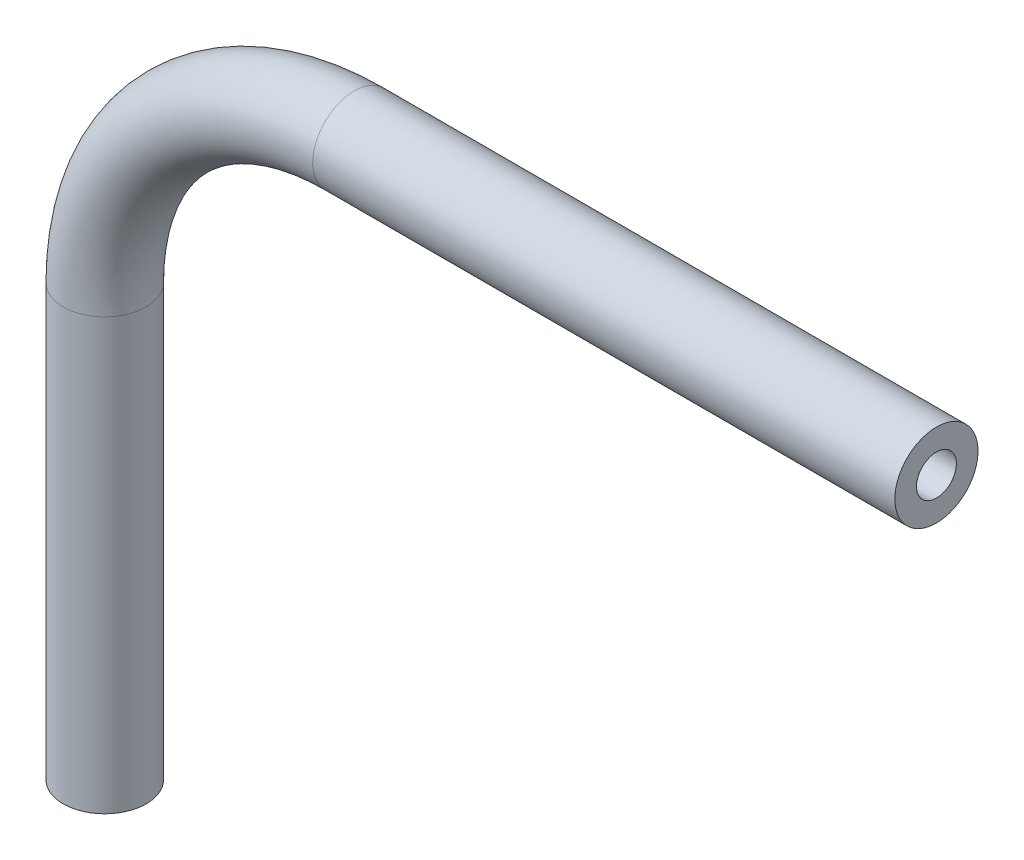
ISO-10303-21;
HEADER;
FILE_DESCRIPTION(('STEP AP214'),'2;1');
FILE_NAME('part.step','',(''),(''),'','','');
FILE_SCHEMA(('AUTOMOTIVE_DESIGN { 1 0 10303 214 1 1 1 1 }'));
ENDSEC;
DATA;
#1=APPLICATION_CONTEXT('core data for automotive mechanical design processes');
#2=APPLICATION_PROTOCOL_DEFINITION('international standard','automotive_design',2000,#1);
#3=PRODUCT_CONTEXT('',#1,'mechanical');
#4=PRODUCT('Part','Part','',(#3));
#5=PRODUCT_RELATED_PRODUCT_CATEGORY('part','',(#4));
#6=PRODUCT_DEFINITION_FORMATION('','',#4);
#7=PRODUCT_DEFINITION_CONTEXT('part definition',#1,'design');
#8=PRODUCT_DEFINITION('design','',#6,#7);
#9=PRODUCT_DEFINITION_SHAPE('','',#8);
#10=(LENGTH_UNIT() NAMED_UNIT(*) SI_UNIT(.MILLI.,.METRE.));
#11=(NAMED_UNIT(*) PLANE_ANGLE_UNIT() SI_UNIT($,.RADIAN.));
#12=(NAMED_UNIT(*) SI_UNIT($,.STERADIAN.) SOLID_ANGLE_UNIT());
#13=UNCERTAINTY_MEASURE_WITH_UNIT(LENGTH_MEASURE(1.E-05),#10,'distance_accuracy_value','');
#14=(GEOMETRIC_REPRESENTATION_CONTEXT(3) GLOBAL_UNCERTAINTY_ASSIGNED_CONTEXT((#13)) GLOBAL_UNIT_ASSIGNED_CONTEXT((#10,
#11,#12)) REPRESENTATION_CONTEXT('',''));
#15=CARTESIAN_POINT('',(0.,0.,0.));
#16=DIRECTION('',(0.,0.,1.));
#17=DIRECTION('',(1.,0.,0.));
#18=AXIS2_PLACEMENT_3D('',#15,#16,#17);
#19=CARTESIAN_POINT('',(0.,-34.3807738807946,0.));
#20=DIRECTION('',(0.,1.,0.));
#21=DIRECTION('',(-1.,0.,0.));
#22=AXIS2_PLACEMENT_3D('',#19,#20,#21);
#23=CYLINDRICAL_SURFACE('',#22,3.175);
#24=CARTESIAN_POINT('',(0.,-1.52231788079482,0.));
#25=DIRECTION('',(0.,1.,0.));
#26=DIRECTION('',(-1.,0.,0.));
#27=AXIS2_PLACEMENT_3D('',#24,#25,#26);
#28=CIRCLE('',#27,3.175);
#29=CARTESIAN_POINT('',(-3.175,-1.52231788079484,0.));
#30=VERTEX_POINT('',#29);
#31=EDGE_CURVE('E84',#30,#30,#28,.T.);
#32=ORIENTED_EDGE('',*,*,#31,.F.);
#33=EDGE_LOOP('',(#32));
#34=FACE_BOUND('',#33,.T.);
#35=CARTESIAN_POINT('',(0.,-34.3807738807946,0.));
#36=DIRECTION('',(0.,1.,0.));
#37=DIRECTION('',(-1.,0.,0.));
#38=AXIS2_PLACEMENT_3D('',#35,#36,#37);
#39=CIRCLE('',#38,3.175);
#40=CARTESIAN_POINT('',(-3.175,-34.3807738807946,0.));
#41=VERTEX_POINT('',#40);
#42=EDGE_CURVE('E53',#41,#41,#39,.T.);
#43=ORIENTED_EDGE('',*,*,#42,.T.);
#44=EDGE_LOOP('',(#43));
#45=FACE_BOUND('',#44,.T.);
#46=ADVANCED_FACE('F38',(#34,#45),#23,.T.);
#47=CARTESIAN_POINT('',(19.05,-1.52231788079469,0.));
#48=DIRECTION('',(0.,0.,-1.));
#49=DIRECTION('',(-1.,0.,0.));
#50=AXIS2_PLACEMENT_3D('',#47,#48,#49);
#51=TOROIDAL_SURFACE('',#50,19.05,3.175);
#52=CARTESIAN_POINT('',(19.0500000000001,17.5276821192053,0.));
#53=DIRECTION('',(1.,0.,0.));
#54=DIRECTION('',(0.,1.,0.));
#55=AXIS2_PLACEMENT_3D('',#52,#53,#54);
#56=CIRCLE('',#55,3.175);
#57=CARTESIAN_POINT('',(19.0500000000001,20.7026821192053,0.));
#58=VERTEX_POINT('',#57);
#59=EDGE_CURVE('E42',#58,#58,#56,.T.);
#60=CARTESIAN_POINT('',(19.05,-1.52231788079469,0.));
#61=DIRECTION('',(0.,0.,-1.));
#62=DIRECTION('',(-1.,0.,0.));
#63=AXIS2_PLACEMENT_3D('',#60,#61,#62);
#64=CIRCLE('',#63,22.225);
#65=EDGE_CURVE('',#30,#58,#64,.T.);
#66=ORIENTED_EDGE('',*,*,#31,.T.);
#67=ORIENTED_EDGE('',*,*,#59,.F.);
#68=ORIENTED_EDGE('',*,*,#65,.T.);
#69=ORIENTED_EDGE('',*,*,#65,.F.);
#70=EDGE_LOOP('',(#66,#68,#67,#69));
#71=FACE_BOUND('',#70,.T.);
#72=ADVANCED_FACE('F92',(#71),#51,.T.);
#73=CARTESIAN_POINT('',(19.0500000000001,17.5276821192053,0.));
#74=DIRECTION('',(1.,0.,0.));
#75=DIRECTION('',(0.,1.,0.));
#76=AXIS2_PLACEMENT_3D('',#73,#74,#75);
#77=CYLINDRICAL_SURFACE('',#76,3.175);
#78=CARTESIAN_POINT('',(63.5,17.5276821192052,0.));
#79=DIRECTION('',(1.,0.,0.));
#80=DIRECTION('',(0.,1.,0.));
#81=AXIS2_PLACEMENT_3D('',#78,#79,#80);
#82=CIRCLE('',#81,3.175);
#83=CARTESIAN_POINT('',(63.5,20.7026821192052,0.));
#84=VERTEX_POINT('',#83);
#85=EDGE_CURVE('E58',#84,#84,#82,.T.);
#86=ORIENTED_EDGE('',*,*,#85,.F.);
#87=EDGE_LOOP('',(#86));
#88=FACE_BOUND('',#87,.T.);
#89=ORIENTED_EDGE('',*,*,#59,.T.);
#90=EDGE_LOOP('',(#89));
#91=FACE_BOUND('',#90,.T.);
#92=ADVANCED_FACE('F40',(#88,#91),#77,.T.);
#93=CARTESIAN_POINT('',(0.,-34.3807738807946,0.));
#94=DIRECTION('',(0.,1.,0.));
#95=DIRECTION('',(-1.,0.,0.));
#96=AXIS2_PLACEMENT_3D('',#93,#94,#95);
#97=PLANE('',#96);
#98=CARTESIAN_POINT('',(0.,-34.3807738807946,0.));
#99=DIRECTION('',(0.,1.,0.));
#100=DIRECTION('',(-1.,0.,0.));
#101=AXIS2_PLACEMENT_3D('',#98,#99,#100);
#102=CIRCLE('',#101,1.524);
#103=CARTESIAN_POINT('',(-1.524,-34.3807738807946,0.));
#104=VERTEX_POINT('',#103);
#105=EDGE_CURVE('E79',#104,#104,#102,.F.);
#106=ORIENTED_EDGE('',*,*,#105,.F.);
#107=EDGE_LOOP('',(#106));
#108=FACE_BOUND('',#107,.T.);
#109=ORIENTED_EDGE('',*,*,#42,.F.);
#110=EDGE_LOOP('',(#109));
#111=FACE_BOUND('',#110,.T.);
#112=ADVANCED_FACE('F98',(#108,#111),#97,.F.);
#113=CARTESIAN_POINT('',(63.5,17.5276821192052,0.));
#114=DIRECTION('',(1.,0.,0.));
#115=DIRECTION('',(0.,1.,0.));
#116=AXIS2_PLACEMENT_3D('',#113,#114,#115);
#117=PLANE('',#116);
#118=CARTESIAN_POINT('',(63.5,17.5276821192052,0.));
#119=DIRECTION('',(1.,0.,0.));
#120=DIRECTION('',(0.,1.,0.));
#121=AXIS2_PLACEMENT_3D('',#118,#119,#120);
#122=CIRCLE('',#121,1.524);
#123=CARTESIAN_POINT('',(63.5,19.0516821192052,0.));
#124=VERTEX_POINT('',#123);
#125=EDGE_CURVE('E11',#124,#124,#122,.F.);
#126=ORIENTED_EDGE('',*,*,#125,.T.);
#127=EDGE_LOOP('',(#126));
#128=FACE_BOUND('',#127,.T.);
#129=ORIENTED_EDGE('',*,*,#85,.T.);
#130=EDGE_LOOP('',(#129));
#131=FACE_BOUND('',#130,.T.);
#132=ADVANCED_FACE('F65',(#128,#131),#117,.T.);
#133=CARTESIAN_POINT('',(0.,-34.3807738807946,0.));
#134=DIRECTION('',(0.,1.,0.));
#135=DIRECTION('',(-1.,0.,0.));
#136=AXIS2_PLACEMENT_3D('',#133,#134,#135);
#137=CYLINDRICAL_SURFACE('',#136,1.524);
#138=CARTESIAN_POINT('',(0.,-1.52231788079482,0.));
#139=DIRECTION('',(0.,1.,0.));
#140=DIRECTION('',(-1.,0.,0.));
#141=AXIS2_PLACEMENT_3D('',#138,#139,#140);
#142=CIRCLE('',#141,1.524);
#143=CARTESIAN_POINT('',(-1.524,-1.52231788079483,0.));
#144=VERTEX_POINT('',#143);
#145=EDGE_CURVE('E76',#144,#144,#142,.F.);
#146=ORIENTED_EDGE('',*,*,#145,.F.);
#147=EDGE_LOOP('',(#146));
#148=FACE_BOUND('',#147,.T.);
#149=ORIENTED_EDGE('',*,*,#105,.T.);
#150=EDGE_LOOP('',(#149));
#151=FACE_BOUND('',#150,.T.);
#152=ADVANCED_FACE('F106',(#148,#151),#137,.F.);
#153=CARTESIAN_POINT('',(19.05,-1.52231788079469,0.));
#154=DIRECTION('',(0.,0.,-1.));
#155=DIRECTION('',(-1.,0.,0.));
#156=AXIS2_PLACEMENT_3D('',#153,#154,#155);
#157=TOROIDAL_SURFACE('',#156,19.05,1.524);
#158=CARTESIAN_POINT('',(19.0500000000001,17.5276821192053,0.));
#159=DIRECTION('',(1.,0.,0.));
#160=DIRECTION('',(0.,1.,0.));
#161=AXIS2_PLACEMENT_3D('',#158,#159,#160);
#162=CIRCLE('',#161,1.524);
#163=CARTESIAN_POINT('',(19.0500000000001,19.0516821192053,0.));
#164=VERTEX_POINT('',#163);
#165=EDGE_CURVE('E47',#164,#164,#162,.F.);
#166=CARTESIAN_POINT('',(19.05,-1.52231788079469,0.));
#167=DIRECTION('',(0.,0.,-1.));
#168=DIRECTION('',(-1.,0.,0.));
#169=AXIS2_PLACEMENT_3D('',#166,#167,#168);
#170=CIRCLE('',#169,20.574);
#171=EDGE_CURVE('',#144,#164,#170,.T.);
#172=ORIENTED_EDGE('',*,*,#145,.T.);
#173=ORIENTED_EDGE('',*,*,#165,.F.);
#174=ORIENTED_EDGE('',*,*,#171,.T.);
#175=ORIENTED_EDGE('',*,*,#171,.F.);
#176=EDGE_LOOP('',(#172,#174,#173,#175));
#177=FACE_BOUND('',#176,.T.);
#178=ADVANCED_FACE('F71',(#177),#157,.F.);
#179=CARTESIAN_POINT('',(19.0500000000001,17.5276821192053,0.));
#180=DIRECTION('',(1.,0.,0.));
#181=DIRECTION('',(0.,1.,0.));
#182=AXIS2_PLACEMENT_3D('',#179,#180,#181);
#183=CYLINDRICAL_SURFACE('',#182,1.524);
#184=ORIENTED_EDGE('',*,*,#125,.F.);
#185=EDGE_LOOP('',(#184));
#186=FACE_BOUND('',#185,.T.);
#187=ORIENTED_EDGE('',*,*,#165,.T.);
#188=EDGE_LOOP('',(#187));
#189=FACE_BOUND('',#188,.T.);
#190=ADVANCED_FACE('F68',(#186,#189),#183,.F.);
#191=CLOSED_SHELL('',(#46,#72,#92,#112,#132,#152,#178,#190));
#192=MANIFOLD_SOLID_BREP('B2',#191);
#193=ADVANCED_BREP_SHAPE_REPRESENTATION('',(#18,#192),#14);
#194=SHAPE_DEFINITION_REPRESENTATION(#9,#193);
ENDSEC;
END-ISO-10303-21;
